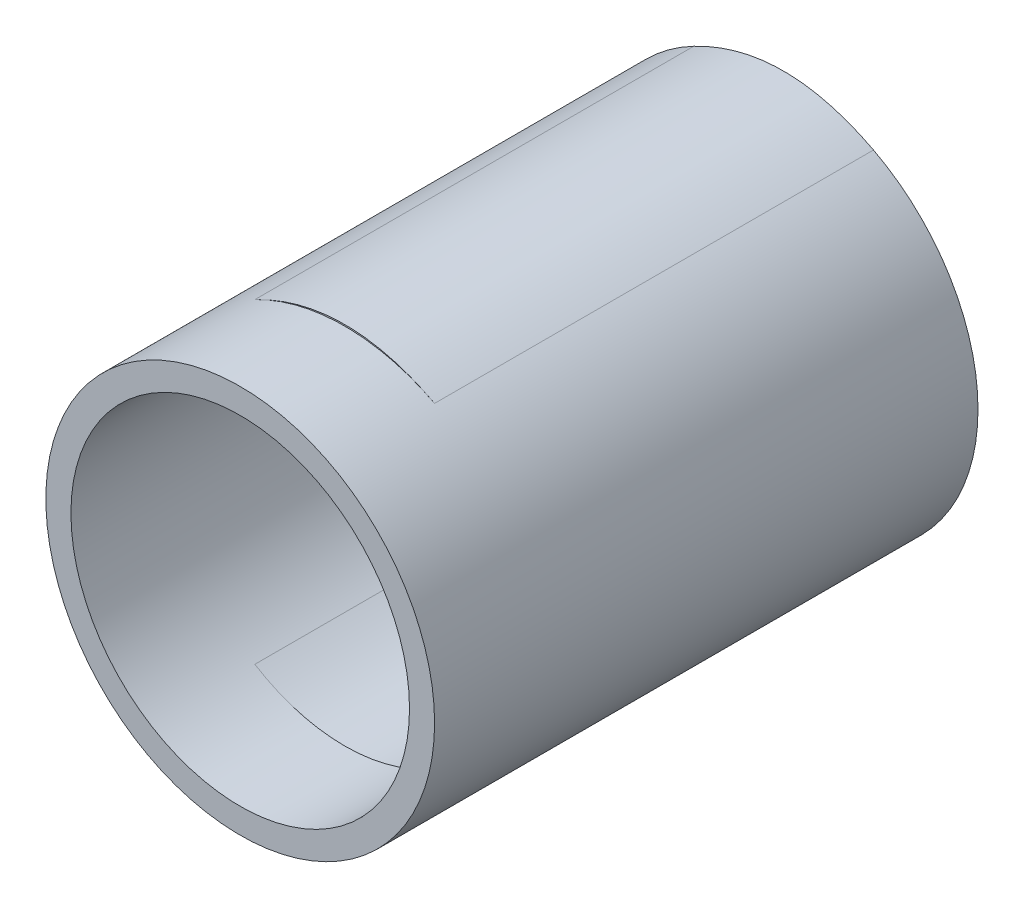
ISO-10303-21;
HEADER;
FILE_DESCRIPTION(('STEP AP214'),'2;1');
FILE_NAME('part.step','',(''),(''),'','','');
FILE_SCHEMA(('AUTOMOTIVE_DESIGN { 1 0 10303 214 1 1 1 1 }'));
ENDSEC;
DATA;
#1=APPLICATION_CONTEXT('core data for automotive mechanical design processes');
#2=APPLICATION_PROTOCOL_DEFINITION('international standard','automotive_design',2000,#1);
#3=PRODUCT_CONTEXT('',#1,'mechanical');
#4=PRODUCT('Part','Part','',(#3));
#5=PRODUCT_RELATED_PRODUCT_CATEGORY('part','',(#4));
#6=PRODUCT_DEFINITION_FORMATION('','',#4);
#7=PRODUCT_DEFINITION_CONTEXT('part definition',#1,'design');
#8=PRODUCT_DEFINITION('design','',#6,#7);
#9=PRODUCT_DEFINITION_SHAPE('','',#8);
#10=(LENGTH_UNIT() NAMED_UNIT(*) SI_UNIT(.MILLI.,.METRE.));
#11=(NAMED_UNIT(*) PLANE_ANGLE_UNIT() SI_UNIT($,.RADIAN.));
#12=(NAMED_UNIT(*) SI_UNIT($,.STERADIAN.) SOLID_ANGLE_UNIT());
#13=UNCERTAINTY_MEASURE_WITH_UNIT(LENGTH_MEASURE(1.E-05),#10,'distance_accuracy_value','');
#14=(GEOMETRIC_REPRESENTATION_CONTEXT(3) GLOBAL_UNCERTAINTY_ASSIGNED_CONTEXT((#13)) GLOBAL_UNIT_ASSIGNED_CONTEXT((#10,
#11,#12)) REPRESENTATION_CONTEXT('',''));
#15=CARTESIAN_POINT('',(0.,0.,0.));
#16=DIRECTION('',(0.,0.,1.));
#17=DIRECTION('',(1.,0.,0.));
#18=AXIS2_PLACEMENT_3D('',#15,#16,#17);
#19=CARTESIAN_POINT('',(0.,0.,2600.));
#20=DIRECTION('',(0.,0.,1.));
#21=DIRECTION('',(1.,0.,0.));
#22=AXIS2_PLACEMENT_3D('',#19,#20,#21);
#23=PLANE('',#22);
#24=CARTESIAN_POINT('',(-2800.,122.630047172472,2600.));
#25=DIRECTION('',(0.,0.,1.));
#26=DIRECTION('',(1.,0.,0.));
#27=AXIS2_PLACEMENT_3D('',#24,#25,#26);
#28=CIRCLE('',#27,930.);
#29=CARTESIAN_POINT('',(-1870.,122.630047172472,2600.));
#30=VERTEX_POINT('',#29);
#31=EDGE_CURVE('P0_E253',#30,#30,#28,.T.);
#32=ORIENTED_EDGE('',*,*,#31,.T.);
#33=EDGE_LOOP('',(#32));
#34=FACE_BOUND('',#33,.T.);
#35=CARTESIAN_POINT('',(-2800.,122.630047172471,2600.));
#36=DIRECTION('',(0.,0.,1.));
#37=DIRECTION('',(1.,0.,0.));
#38=AXIS2_PLACEMENT_3D('',#35,#36,#37);
#39=CIRCLE('',#38,810.);
#40=CARTESIAN_POINT('',(-1990.,122.630047172471,2600.));
#41=VERTEX_POINT('',#40);
#42=EDGE_CURVE('P0_E10',#41,#41,#39,.T.);
#43=ORIENTED_EDGE('',*,*,#42,.F.);
#44=EDGE_LOOP('',(#43));
#45=FACE_BOUND('',#44,.T.);
#46=ADVANCED_FACE('P0_F16',(#34,#45),#23,.T.);
#47=CARTESIAN_POINT('',(-2800.,122.630047172472,1300.));
#48=DIRECTION('',(0.,0.,1.));
#49=DIRECTION('',(1.,0.,0.));
#50=AXIS2_PLACEMENT_3D('',#47,#48,#49);
#51=CYLINDRICAL_SURFACE('',#50,930.);
#52=ORIENTED_EDGE('',*,*,#31,.F.);
#53=EDGE_LOOP('',(#52));
#54=FACE_BOUND('',#53,.T.);
#55=CARTESIAN_POINT('',(-2800.,122.630047172472,2100.));
#56=DIRECTION('',(0.,0.,-1.));
#57=DIRECTION('',(1.,0.,0.));
#58=AXIS2_PLACEMENT_3D('',#55,#56,#57);
#59=CIRCLE('',#58,930.);
#60=CARTESIAN_POINT('',(-3230.,947.251172296004,2100.));
#61=VERTEX_POINT('',#60);
#62=CARTESIAN_POINT('',(-2370.00131801305,947.251859574671,2100.));
#63=VERTEX_POINT('',#62);
#64=EDGE_CURVE('P0_E33',#61,#63,#59,.T.);
#65=ORIENTED_EDGE('',*,*,#64,.F.);
#66=DIRECTION('',(0.,0.,1.));
#67=VECTOR('',#66,1.);
#68=CARTESIAN_POINT('',(-3230.,947.251172296004,1300.));
#69=LINE('',#68,#67);
#70=CARTESIAN_POINT('',(-3230.,947.251172296004,0.));
#71=VERTEX_POINT('',#70);
#72=EDGE_CURVE('P0_E191',#71,#61,#69,.T.);
#73=ORIENTED_EDGE('',*,*,#72,.F.);
#74=CARTESIAN_POINT('',(-2800.,122.630047172472,0.));
#75=DIRECTION('',(0.,0.,1.));
#76=DIRECTION('',(1.,0.,0.));
#77=AXIS2_PLACEMENT_3D('',#74,#75,#76);
#78=CIRCLE('',#77,930.);
#79=CARTESIAN_POINT('',(-3230.,-701.99107795106,0.));
#80=VERTEX_POINT('',#79);
#81=EDGE_CURVE('P0_E120',#71,#80,#78,.T.);
#82=ORIENTED_EDGE('',*,*,#81,.T.);
#83=DIRECTION('',(0.,0.,1.));
#84=VECTOR('',#83,1.);
#85=CARTESIAN_POINT('',(-3230.,-701.99107795106,1300.));
#86=LINE('',#85,#84);
#87=CARTESIAN_POINT('',(-3230.,-701.99107795106,2100.));
#88=VERTEX_POINT('',#87);
#89=EDGE_CURVE('P0_E174',#80,#88,#86,.T.);
#90=ORIENTED_EDGE('',*,*,#89,.T.);
#91=CARTESIAN_POINT('',(-2800.,122.630047172472,2100.));
#92=DIRECTION('',(0.,0.,-1.));
#93=DIRECTION('',(1.,0.,0.));
#94=AXIS2_PLACEMENT_3D('',#91,#92,#93);
#95=CIRCLE('',#94,930.);
#96=CARTESIAN_POINT('',(-2370.00222482594,-701.99223808709,2100.));
#97=VERTEX_POINT('',#96);
#98=EDGE_CURVE('P0_E197',#97,#88,#95,.T.);
#99=ORIENTED_EDGE('',*,*,#98,.F.);
#100=CARTESIAN_POINT('',(-2800.,122.630047172472,2100.));
#101=DIRECTION('',(0.,0.,1.));
#102=DIRECTION('',(1.,0.,0.));
#103=AXIS2_PLACEMENT_3D('',#100,#101,#102);
#104=CIRCLE('',#103,930.);
#105=CARTESIAN_POINT('',(-2370.00000000001,-701.991077951063,2100.));
#106=VERTEX_POINT('',#105);
#107=EDGE_CURVE('P0_E119',#97,#106,#104,.T.);
#108=ORIENTED_EDGE('',*,*,#107,.T.);
#109=DIRECTION('',(0.,0.,1.));
#110=VECTOR('',#109,1.);
#111=CARTESIAN_POINT('',(-2370.,-701.99107795106,1300.));
#112=LINE('',#111,#110);
#113=CARTESIAN_POINT('',(-2370.00000000001,-701.991077951059,0.));
#114=VERTEX_POINT('',#113);
#115=EDGE_CURVE('P0_E113',#114,#106,#112,.T.);
#116=ORIENTED_EDGE('',*,*,#115,.F.);
#117=CARTESIAN_POINT('',(-2800.,122.630047172472,0.));
#118=DIRECTION('',(0.,0.,1.));
#119=DIRECTION('',(1.,0.,0.));
#120=AXIS2_PLACEMENT_3D('',#117,#118,#119);
#121=CIRCLE('',#120,930.);
#122=CARTESIAN_POINT('',(-2370.,947.251172296004,0.));
#123=VERTEX_POINT('',#122);
#124=EDGE_CURVE('P0_E108',#114,#123,#121,.T.);
#125=ORIENTED_EDGE('',*,*,#124,.T.);
#126=DIRECTION('',(0.,0.,1.));
#127=VECTOR('',#126,1.);
#128=CARTESIAN_POINT('',(-2370.,947.251172296004,1300.));
#129=LINE('',#128,#127);
#130=CARTESIAN_POINT('',(-2370.,947.251172296004,2100.));
#131=VERTEX_POINT('',#130);
#132=EDGE_CURVE('P0_E111',#123,#131,#129,.T.);
#133=ORIENTED_EDGE('',*,*,#132,.T.);
#134=CARTESIAN_POINT('',(-2800.,122.630047172472,2100.));
#135=DIRECTION('',(0.,0.,-1.));
#136=DIRECTION('',(1.,0.,0.));
#137=AXIS2_PLACEMENT_3D('',#134,#135,#136);
#138=CIRCLE('',#137,930.);
#139=EDGE_CURVE('P0_E42',#63,#131,#138,.T.);
#140=ORIENTED_EDGE('',*,*,#139,.F.);
#141=EDGE_LOOP('',(#65,#73,#82,#90,#99,#108,#116,#125,#133,#140));
#142=FACE_BOUND('',#141,.T.);
#143=ADVANCED_FACE('P0_F110',(#54,#142),#51,.T.);
#144=CARTESIAN_POINT('',(-2800.,122.630047172471,1250.));
#145=DIRECTION('',(0.,0.,1.));
#146=DIRECTION('',(1.,0.,0.));
#147=AXIS2_PLACEMENT_3D('',#144,#145,#146);
#148=CYLINDRICAL_SURFACE('',#147,810.);
#149=CARTESIAN_POINT('',(-2800.,122.630047172471,0.));
#150=DIRECTION('',(0.,0.,1.));
#151=DIRECTION('',(1.,0.,0.));
#152=AXIS2_PLACEMENT_3D('',#149,#150,#151);
#153=CIRCLE('',#152,810.);
#154=CARTESIAN_POINT('',(-3230.,809.070139241692,0.));
#155=VERTEX_POINT('',#154);
#156=CARTESIAN_POINT('',(-3230.,-563.810044896749,0.));
#157=VERTEX_POINT('',#156);
#158=EDGE_CURVE('P0_E261',#155,#157,#153,.T.);
#159=ORIENTED_EDGE('',*,*,#158,.F.);
#160=DIRECTION('',(0.,0.,1.));
#161=VECTOR('',#160,1.);
#162=CARTESIAN_POINT('',(-3230.,809.070139241692,1250.));
#163=LINE('',#162,#161);
#164=CARTESIAN_POINT('',(-3230.,809.070139241691,2100.));
#165=VERTEX_POINT('',#164);
#166=EDGE_CURVE('P0_E129',#155,#165,#163,.T.);
#167=ORIENTED_EDGE('',*,*,#166,.T.);
#168=CARTESIAN_POINT('',(-2800.,122.630047172471,2100.));
#169=DIRECTION('',(0.,0.,-1.));
#170=DIRECTION('',(1.,0.,0.));
#171=AXIS2_PLACEMENT_3D('',#168,#169,#170);
#172=CIRCLE('',#171,810.);
#173=CARTESIAN_POINT('',(-2370.00122280143,809.070905227799,2100.));
#174=VERTEX_POINT('',#173);
#175=EDGE_CURVE('P0_E275',#165,#174,#172,.T.);
#176=ORIENTED_EDGE('',*,*,#175,.T.);
#177=CARTESIAN_POINT('',(-2800.,122.630047172471,2100.));
#178=DIRECTION('',(0.,0.,-1.));
#179=DIRECTION('',(1.,0.,0.));
#180=AXIS2_PLACEMENT_3D('',#177,#178,#179);
#181=CIRCLE('',#180,810.);
#182=CARTESIAN_POINT('',(-2370.,809.070139241692,2100.));
#183=VERTEX_POINT('',#182);
#184=EDGE_CURVE('P0_E155',#174,#183,#181,.T.);
#185=ORIENTED_EDGE('',*,*,#184,.T.);
#186=DIRECTION('',(0.,0.,1.));
#187=VECTOR('',#186,1.);
#188=CARTESIAN_POINT('',(-2370.,809.070139241692,1250.));
#189=LINE('',#188,#187);
#190=CARTESIAN_POINT('',(-2370.,809.070139241692,0.));
#191=VERTEX_POINT('',#190);
#192=EDGE_CURVE('P0_E207',#191,#183,#189,.T.);
#193=ORIENTED_EDGE('',*,*,#192,.F.);
#194=CARTESIAN_POINT('',(-2800.,122.630047172471,0.));
#195=DIRECTION('',(0.,0.,1.));
#196=DIRECTION('',(1.,0.,0.));
#197=AXIS2_PLACEMENT_3D('',#194,#195,#196);
#198=CIRCLE('',#197,810.);
#199=CARTESIAN_POINT('',(-2370.00000000001,-563.810044896748,0.));
#200=VERTEX_POINT('',#199);
#201=EDGE_CURVE('P0_E266',#200,#191,#198,.T.);
#202=ORIENTED_EDGE('',*,*,#201,.F.);
#203=DIRECTION('',(0.,0.,1.));
#204=VECTOR('',#203,1.);
#205=CARTESIAN_POINT('',(-2370.,-563.810044896749,1250.));
#206=LINE('',#205,#204);
#207=CARTESIAN_POINT('',(-2370.,-563.81004489675,2100.));
#208=VERTEX_POINT('',#207);
#209=EDGE_CURVE('P0_E144',#200,#208,#206,.T.);
#210=ORIENTED_EDGE('',*,*,#209,.T.);
#211=CARTESIAN_POINT('',(-2800.,122.630047172471,2100.));
#212=DIRECTION('',(0.,0.,1.));
#213=DIRECTION('',(1.,0.,0.));
#214=AXIS2_PLACEMENT_3D('',#211,#212,#213);
#215=CIRCLE('',#214,810.);
#216=CARTESIAN_POINT('',(-2370.00181964397,-563.811184755291,2100.));
#217=VERTEX_POINT('',#216);
#218=EDGE_CURVE('P0_E69',#217,#208,#215,.T.);
#219=ORIENTED_EDGE('',*,*,#218,.F.);
#220=CARTESIAN_POINT('',(-2800.,122.630047172471,2100.));
#221=DIRECTION('',(0.,0.,-1.));
#222=DIRECTION('',(1.,0.,0.));
#223=AXIS2_PLACEMENT_3D('',#220,#221,#222);
#224=CIRCLE('',#223,810.);
#225=CARTESIAN_POINT('',(-3230.,-563.810044896749,2100.));
#226=VERTEX_POINT('',#225);
#227=EDGE_CURVE('P0_E56',#217,#226,#224,.T.);
#228=ORIENTED_EDGE('',*,*,#227,.T.);
#229=DIRECTION('',(0.,0.,1.));
#230=VECTOR('',#229,1.);
#231=CARTESIAN_POINT('',(-3230.,-563.810044896749,1250.));
#232=LINE('',#231,#230);
#233=EDGE_CURVE('P0_E204',#157,#226,#232,.T.);
#234=ORIENTED_EDGE('',*,*,#233,.F.);
#235=EDGE_LOOP('',(#159,#167,#176,#185,#193,#202,#210,#219,#228,#234));
#236=FACE_BOUND('',#235,.T.);
#237=ORIENTED_EDGE('',*,*,#42,.T.);
#238=EDGE_LOOP('',(#237));
#239=FACE_BOUND('',#238,.T.);
#240=ADVANCED_FACE('P0_F224',(#236,#239),#148,.F.);
#241=CARTESIAN_POINT('',(-2800.,878.160655768848,2100.));
#242=DIRECTION('',(0.,0.,1.));
#243=DIRECTION('',(1.,0.,0.));
#244=AXIS2_PLACEMENT_3D('',#241,#242,#243);
#245=PLANE('',#244);
#246=ORIENTED_EDGE('',*,*,#64,.T.);
#247=CARTESIAN_POINT('',(-3230.,947.251172296004,2100.));
#248=CARTESIAN_POINT('',(-3222.20092994091,951.318019474959,2100.));
#249=CARTESIAN_POINT('',(-3214.35633617281,955.297943324625,2100.));
#250=CARTESIAN_POINT('',(-3198.56849206611,963.079979662334,2100.));
#251=CARTESIAN_POINT('',(-3190.6251406006,966.881886921991,2100.));
#252=CARTESIAN_POINT('',(-3174.64368885549,974.297537491168,2100.));
#253=CARTESIAN_POINT('',(-3166.60552137445,977.911136115052,2100.));
#254=CARTESIAN_POINT('',(-3150.43860917072,984.940089923465,2100.));
#255=CARTESIAN_POINT('',(-3142.30982527482,988.355355067149,2100.));
#256=CARTESIAN_POINT('',(-3125.96597668347,994.977926893992,2100.));
#257=CARTESIAN_POINT('',(-3117.75089464635,998.185190812937,2100.));
#258=CARTESIAN_POINT('',(-3101.2389246426,1004.38242664369,2100.));
#259=CARTESIAN_POINT('',(-3092.94203505006,1007.37239422687,2100.));
#260=CARTESIAN_POINT('',(-3076.2903998265,1013.11946625621,2100.));
#261=CARTESIAN_POINT('',(-3067.93584278906,1015.87711670302,2100.));
#262=CARTESIAN_POINT('',(-3051.15508013722,1021.15876065921,2100.));
#263=CARTESIAN_POINT('',(-3042.72889009613,1023.68280360561,2100.));
#264=CARTESIAN_POINT('',(-3025.80992339723,1028.48934931005,2100.));
#265=CARTESIAN_POINT('',(-3017.31716242277,1030.771907225,2100.));
#266=CARTESIAN_POINT('',(-3000.27025900866,1035.08815830342,2100.));
#267=CARTESIAN_POINT('',(-2991.71612828112,1037.12189768198,2100.));
#268=CARTESIAN_POINT('',(-2974.55183985286,1040.933777964,2100.));
#269=CARTESIAN_POINT('',(-2965.94168713535,1042.71194128492,2100.));
#270=CARTESIAN_POINT('',(-2948.67087149232,1046.00655901062,2100.));
#271=CARTESIAN_POINT('',(-2940.01020554205,1047.52299757329,2100.));
#272=CARTESIAN_POINT('',(-2922.56383315789,1050.30148487971,2100.));
#273=CARTESIAN_POINT('',(-2913.77772003236,1051.5609831664,2100.));
#274=CARTESIAN_POINT('',(-2896.16842966723,1053.80263733334,2100.));
#275=CARTESIAN_POINT('',(-2887.3452456055,1054.78473967225,2100.));
#276=CARTESIAN_POINT('',(-2869.67114395763,1056.46741383455,2100.));
#277=CARTESIAN_POINT('',(-2860.82022365672,1057.16795717326,2100.));
#278=CARTESIAN_POINT('',(-2843.10006341592,1058.28452391017,2100.));
#279=CARTESIAN_POINT('',(-2834.23082272278,1058.7005353664,2100.));
#280=CARTESIAN_POINT('',(-2816.48351277988,1059.24626594586,2100.));
#281=CARTESIAN_POINT('',(-2807.60544351442,1059.37598455927,2100.));
#282=CARTESIAN_POINT('',(-2789.85004608982,1059.34858710436,2100.));
#283=CARTESIAN_POINT('',(-2780.97271791579,1059.19148066462,2100.));
#284=CARTESIAN_POINT('',(-2763.22813434758,1058.59112018387,2100.));
#285=CARTESIAN_POINT('',(-2754.36087853746,1058.1478784234,2100.));
#286=CARTESIAN_POINT('',(-2736.64512432481,1056.9770922389,2100.));
#287=CARTESIAN_POINT('',(-2727.79662602917,1056.24954619912,2100.));
#288=CARTESIAN_POINT('',(-2710.1273352437,1054.51313147191,2100.));
#289=CARTESIAN_POINT('',(-2701.30654266078,1053.50426373069,2100.));
#290=CARTESIAN_POINT('',(-2683.70145984631,1051.20929628689,2100.));
#291=CARTESIAN_POINT('',(-2674.91716828037,1049.92320681148,2100.));
#292=CARTESIAN_POINT('',(-2657.3937654439,1047.07896923277,2100.));
#293=CARTESIAN_POINT('',(-2648.65464943229,1045.5208503008,2100.));
#294=CARTESIAN_POINT('',(-2631.23005684041,1042.13874207667,2100.));
#295=CARTESIAN_POINT('',(-2622.54456861036,1040.31481280933,2100.));
#296=CARTESIAN_POINT('',(-2606.81081299419,1036.76381600275,2100.));
#297=CARTESIAN_POINT('',(-2599.75280093338,1035.07973297853,2100.));
#298=CARTESIAN_POINT('',(-2585.68040813758,1031.54237243682,2099.99999999999));
#299=CARTESIAN_POINT('',(-2578.66602105573,1029.68912017688,2100.));
#300=CARTESIAN_POINT('',(-2564.68328999383,1025.8175085949,2100.));
#301=CARTESIAN_POINT('',(-2557.71494425634,1023.79915561476,2100.));
#302=CARTESIAN_POINT('',(-2543.82658561274,1019.60161240587,2100.));
#303=CARTESIAN_POINT('',(-2536.90657465186,1017.42241574431,2099.99999999999));
#304=CARTESIAN_POINT('',(-2523.11713618799,1012.90763895494,2099.99999999999));
#305=CARTESIAN_POINT('',(-2516.24771302651,1010.57204557464,2099.99999999999));
#306=CARTESIAN_POINT('',(-2502.56164372699,1005.74910003591,2099.99999999999));
#307=CARTESIAN_POINT('',(-2495.74500267062,1003.26173346509,2099.99999999999));
#308=CARTESIAN_POINT('',(-2482.17066506508,998.141545784248,2099.99999999999));
#309=CARTESIAN_POINT('',(-2475.41293959354,995.508801310022,2099.99999999999));
#310=CARTESIAN_POINT('',(-2461.95446553923,990.101456153092,2099.99999999999));
#311=CARTESIAN_POINT('',(-2455.25371730089,987.326854613552,2099.99999999999));
#312=CARTESIAN_POINT('',(-2441.91119866743,981.640851453466,2099.99999999999));
#313=CARTESIAN_POINT('',(-2435.26942345761,978.729461125091,2099.99999999999));
#314=CARTESIAN_POINT('',(-2422.04679195197,972.775059359622,2099.99999999999));
#315=CARTESIAN_POINT('',(-2415.46592351065,969.732074881754,2099.99999999999));
#316=CARTESIAN_POINT('',(-2402.36700957232,963.519785817767,2099.99999999999));
#317=CARTESIAN_POINT('',(-2395.84894240782,960.350526889155,2099.99999999999));
#318=CARTESIAN_POINT('',(-2382.87743301018,953.891074705706,2099.99999999999));
#319=CARTESIAN_POINT('',(-2376.42395746419,950.600948362612,2099.99999999999));
#320=CARTESIAN_POINT('',(-2370.00131801294,947.251859574894,2100.));
#321=B_SPLINE_CURVE_WITH_KNOTS('',3,(#247,#248,#249,#250,#251,#252,#253,#254,#255,#256,#257,
#258,#259,#260,#261,#262,#263,#264,#265,#266,#267,#268,#269,#270,#271,#272,#273,#274,#275,#276,
#277,#278,#279,#280,#281,#282,#283,#284,#285,#286,#287,#288,#289,#290,#291,#292,#293,#294,#295,
#296,#297,#298,#299,#300,#301,#302,#303,#304,#305,#306,#307,#308,#309,#310,#311,#312,#313,#314,
#315,#316,#317,#318,#319,#320),.UNSPECIFIED.,.F.,.F.,(4,2,2,2,2,2,2,2,2,2,2,2,2,2,2,2,2,2,2,2,2,
2,2,2,2,2,2,2,2,2,2,2,2,2,2,2,4),(0.,26.3868803566043,52.8034676419651,79.2400613898281,
105.68856466482,132.142488518929,158.5969392029,184.987372260557,211.372207627873,
237.75100343899,264.124892239022,290.49646627905,316.869636020408,343.493061721773,
370.121622614404,396.752876780247,423.385248606111,450.017667858044,476.649193088612,
503.279575404532,529.910109068869,556.540553165901,583.170014991701,609.796622935783,
636.417227397026,658.183619622164,679.946767347261,701.709079491946,723.472262475,
745.237291932137,767.004391426028,788.760123972941,810.515987942825,832.270059070266,
854.019694437728,875.761535834828,897.491517233458),.UNSPECIFIED.);
#322=EDGE_CURVE('P0_E135',#61,#63,#321,.T.);
#323=ORIENTED_EDGE('',*,*,#322,.F.);
#324=EDGE_LOOP('',(#246,#323));
#325=FACE_BOUND('',#324,.T.);
#326=ADVANCED_FACE('P0_F219',(#325),#245,.T.);
#327=CARTESIAN_POINT('',(-3230.,947.251172296004,2100.));
#328=CARTESIAN_POINT('',(-3230.,947.251172296004,0.));
#329=CARTESIAN_POINT('',(-3057.99999352763,1036.94084981018,2100.));
#330=CARTESIAN_POINT('',(-3057.99999352763,1036.94084980449,0.));
#331=CARTESIAN_POINT('',(-2886.00007800474,1081.78567533374,2100.));
#332=CARTESIAN_POINT('',(-2886.00007800474,1081.78570488096,0.));
#333=CARTESIAN_POINT('',(-2714.0000492785,1081.78569580198,2100.));
#334=CARTESIAN_POINT('',(-2714.0000492785,1081.78569580198,0.));
#335=CARTESIAN_POINT('',(-2542.00000644936,1036.94084981477,2100.));
#336=CARTESIAN_POINT('',(-2542.00000644936,1036.94084981477,0.));
#337=CARTESIAN_POINT('',(-2370.00000000001,947.251172296002,2100.));
#338=CARTESIAN_POINT('',(-2370.,947.251172296003,0.));
#339=B_SPLINE_SURFACE_WITH_KNOTS('',5,1,((#327,#328),(#329,#330),(#331,#332),(#333,#334),(#335,
#336),(#337,#338)),.UNSPECIFIED.,.F.,.F.,.F.,(6,6),(2,2),(0.,990.584508227356),(-1300.,800.),.UNSPECIFIED.);
#340=CARTESIAN_POINT('',(-3230.,947.251172296004,0.));
#341=CARTESIAN_POINT('',(-3057.99999352763,1036.94084980449,0.));
#342=CARTESIAN_POINT('',(-2886.00007800474,1081.78570488096,0.));
#343=CARTESIAN_POINT('',(-2714.0000492785,1081.78569580198,0.));
#344=CARTESIAN_POINT('',(-2542.00000644936,1036.94084981477,0.));
#345=CARTESIAN_POINT('',(-2370.,947.251172296003,0.));
#346=B_SPLINE_CURVE_WITH_KNOTS('',5,(#340,#341,#342,#343,#344,#345),.UNSPECIFIED.,.F.,.F.,(6,6),
(0.,990.584508227356),.UNSPECIFIED.);
#347=EDGE_CURVE('P0_E126',#71,#123,#346,.T.);
#348=ORIENTED_EDGE('',*,*,#139,.T.);
#349=ORIENTED_EDGE('',*,*,#132,.F.);
#350=ORIENTED_EDGE('',*,*,#347,.F.);
#351=ORIENTED_EDGE('',*,*,#72,.T.);
#352=ORIENTED_EDGE('',*,*,#322,.T.);
#353=EDGE_LOOP('',(#348,#349,#350,#351,#352));
#354=FACE_BOUND('',#353,.T.);
#355=ADVANCED_FACE('P0_F124',(#354),#339,.T.);
#356=CARTESIAN_POINT('',(-3230.,809.070139241692,0.));
#357=CARTESIAN_POINT('',(-3230.,809.070139241692,2100.));
#358=CARTESIAN_POINT('',(-3057.99999355947,916.814432789705,0.));
#359=CARTESIAN_POINT('',(-3057.99999352763,916.81443278402,2100.));
#360=CARTESIAN_POINT('',(-2885.99995073914,970.686556676252,0.));
#361=CARTESIAN_POINT('',(-2886.00007800474,970.686554391147,2100.));
#362=CARTESIAN_POINT('',(-2714.0000492785,970.686586240357,0.));
#363=CARTESIAN_POINT('',(-2714.0000492785,970.686588525463,2100.));
#364=CARTESIAN_POINT('',(-2542.00000644936,916.814432795229,0.));
#365=CARTESIAN_POINT('',(-2542.00000644936,916.814432800914,2100.));
#366=CARTESIAN_POINT('',(-2370.00000000001,809.07013924169,0.));
#367=CARTESIAN_POINT('',(-2370.00000000001,809.07013924169,2100.));
#368=B_SPLINE_SURFACE_WITH_KNOTS('',5,1,((#356,#357),(#358,#359),(#360,#361),(#362,#363),(#364,
#365),(#366,#367)),.UNSPECIFIED.,.F.,.F.,.F.,(6,6),(2,2),(0.,990.584508227356),(-1250.,850.),.UNSPECIFIED.);
#369=CARTESIAN_POINT('',(-3230.,809.070139241692,0.));
#370=CARTESIAN_POINT('',(-3057.99999355947,916.814432789705,0.));
#371=CARTESIAN_POINT('',(-2885.99995073914,970.686556676252,0.));
#372=CARTESIAN_POINT('',(-2714.0000492785,970.686586240357,0.));
#373=CARTESIAN_POINT('',(-2542.00000644936,916.814432795229,0.));
#374=CARTESIAN_POINT('',(-2370.00000000001,809.07013924169,0.));
#375=B_SPLINE_CURVE_WITH_KNOTS('',5,(#369,#370,#371,#372,#373,#374),.UNSPECIFIED.,.F.,.F.,(6,6),
(0.,990.584508227356),.UNSPECIFIED.);
#376=EDGE_CURVE('P0_E183',#155,#191,#375,.T.);
#377=CARTESIAN_POINT('',(-3230.,809.070139241692,2100.));
#378=CARTESIAN_POINT('',(-3058.00023808778,916.814279586582,2100.));
#379=CARTESIAN_POINT('',(-2886.00056712478,970.68640119367,2100.));
#380=CARTESIAN_POINT('',(-2714.00078295904,970.68658852499,2100.));
#381=CARTESIAN_POINT('',(-2542.00098469016,916.814739195189,2100.));
#382=CARTESIAN_POINT('',(-2370.00122280075,809.070905227795,2100.));
#383=B_SPLINE_CURVE_WITH_KNOTS('',5,(#377,#378,#379,#380,#381,#382),.UNSPECIFIED.,.F.,.F.,(6,6),
(0.,990.583099753602),.UNSPECIFIED.);
#384=EDGE_CURVE('P0_E146',#165,#174,#383,.T.);
#385=ORIENTED_EDGE('',*,*,#376,.T.);
#386=ORIENTED_EDGE('',*,*,#192,.T.);
#387=ORIENTED_EDGE('',*,*,#184,.F.);
#388=ORIENTED_EDGE('',*,*,#384,.F.);
#389=ORIENTED_EDGE('',*,*,#166,.F.);
#390=EDGE_LOOP('',(#385,#386,#387,#388,#389));
#391=FACE_BOUND('',#390,.T.);
#392=ADVANCED_FACE('P0_F230',(#391),#368,.T.);
#393=CARTESIAN_POINT('',(-3230.,122.630047172472,2100.));
#394=DIRECTION('',(0.,0.,-1.));
#395=DIRECTION('',(-1.,0.,0.));
#396=AXIS2_PLACEMENT_3D('',#393,#394,#395);
#397=PLANE('',#396);
#398=ORIENTED_EDGE('',*,*,#384,.T.);
#399=ORIENTED_EDGE('',*,*,#175,.F.);
#400=EDGE_LOOP('',(#398,#399));
#401=FACE_BOUND('',#400,.T.);
#402=ADVANCED_FACE('P0_F227',(#401),#397,.T.);
#403=CARTESIAN_POINT('',(-3230.,122.630047172472,2100.));
#404=DIRECTION('',(0.,0.,-1.));
#405=DIRECTION('',(-1.,0.,0.));
#406=AXIS2_PLACEMENT_3D('',#403,#404,#405);
#407=PLANE('',#406);
#408=CARTESIAN_POINT('',(-3230.,-563.810044896749,2100.));
#409=CARTESIAN_POINT('',(-3223.22155236649,-568.056179247852,2100.));
#410=CARTESIAN_POINT('',(-3216.39781037365,-572.230327801503,2100.));
#411=CARTESIAN_POINT('',(-3202.64884224145,-580.432945951803,2100.));
#412=CARTESIAN_POINT('',(-3195.72347377319,-584.461176903298,2100.));
#413=CARTESIAN_POINT('',(-3181.77403086753,-592.361179652047,2100.));
#414=CARTESIAN_POINT('',(-3174.74985730047,-596.232776580872,2100.));
#415=CARTESIAN_POINT('',(-3160.6057743509,-603.808819869926,2100.));
#416=CARTESIAN_POINT('',(-3153.48580352949,-607.513151604322,2100.));
#417=CARTESIAN_POINT('',(-3139.15318402017,-614.744200963067,2100.));
#418=CARTESIAN_POINT('',(-3131.9405052369,-618.270858983767,2100.));
#419=CARTESIAN_POINT('',(-3117.42566306149,-625.136318731161,2100.));
#420=CARTESIAN_POINT('',(-3110.12349407277,-628.475108635119,2100.));
#421=CARTESIAN_POINT('',(-3095.38625449391,-634.975468627288,2100.));
#422=CARTESIAN_POINT('',(-3087.95063942295,-638.135805453911,2100.));
#423=CARTESIAN_POINT('',(-3072.99592001022,-644.246145554585,2100.));
#424=CARTESIAN_POINT('',(-3065.47684047647,-647.196209490244,2100.));
#425=CARTESIAN_POINT('',(-3050.35894777146,-652.876464541847,2100.));
#426=CARTESIAN_POINT('',(-3042.76016281115,-655.606730669864,2100.));
#427=CARTESIAN_POINT('',(-3027.48674650829,-660.838241663496,2100.));
#428=CARTESIAN_POINT('',(-3019.81213974615,-663.339558216126,2100.));
#429=CARTESIAN_POINT('',(-3004.3911399556,-668.104441573945,2100.));
#430=CARTESIAN_POINT('',(-2996.64476198433,-670.368057070953,2100.));
#431=CARTESIAN_POINT('',(-2981.08433816092,-674.649286731058,2100.));
#432=CARTESIAN_POINT('',(-2973.27029355099,-676.666905399889,2100.));
#433=CARTESIAN_POINT('',(-2959.01219597416,-680.102981040412,2100.));
#434=CARTESIAN_POINT('',(-2952.57827411557,-681.563595145187,2100.));
#435=CARTESIAN_POINT('',(-2939.6725384801,-684.310897706825,2100.));
#436=CARTESIAN_POINT('',(-2933.20072029534,-685.597565494466,2100.));
#437=CARTESIAN_POINT('',(-2920.22396045497,-687.992992583917,2100.));
#438=CARTESIAN_POINT('',(-2913.71901748972,-689.101744794233,2100.));
#439=CARTESIAN_POINT('',(-2900.68080100647,-691.137894332487,2100.));
#440=CARTESIAN_POINT('',(-2894.14752755853,-692.065292108496,2100.));
#441=CARTESIAN_POINT('',(-2881.05754344444,-693.735815980085,2100.));
#442=CARTESIAN_POINT('',(-2874.50083312233,-694.478944769321,2100.));
#443=CARTESIAN_POINT('',(-2861.36894945912,-695.778566120534,2100.));
#444=CARTESIAN_POINT('',(-2854.79377618487,-696.335059357296,2100.));
#445=CARTESIAN_POINT('',(-2841.65782124085,-697.25765972779,2100.));
#446=CARTESIAN_POINT('',(-2835.09709505616,-697.624556410774,2100.));
#447=CARTESIAN_POINT('',(-2821.96760177988,-698.170293806298,2100.));
#448=CARTESIAN_POINT('',(-2815.39883443052,-698.349128323194,2100.));
#449=CARTESIAN_POINT('',(-2802.25880714002,-698.518132002367,2100.));
#450=CARTESIAN_POINT('',(-2795.68754717478,-698.508299292465,2100.));
#451=CARTESIAN_POINT('',(-2782.5480661663,-698.299996496673,2100.));
#452=CARTESIAN_POINT('',(-2775.9798451005,-698.101527833999,2100.));
#453=CARTESIAN_POINT('',(-2762.85198518757,-697.516619418593,2100.));
#454=CARTESIAN_POINT('',(-2756.29234610185,-697.130185007688,2100.));
#455=CARTESIAN_POINT('',(-2743.18710363938,-696.170628900065,2100.));
#456=CARTESIAN_POINT('',(-2736.64149942334,-695.597518698869,2100.));
#457=CARTESIAN_POINT('',(-2725.21061678679,-694.433610514281,2100.));
#458=CARTESIAN_POINT('',(-2720.3211616891,-693.883393518058,2100.));
#459=CARTESIAN_POINT('',(-2710.55479752477,-692.680281225017,2100.));
#460=CARTESIAN_POINT('',(-2705.67788865988,-692.027384287524,2100.));
#461=CARTESIAN_POINT('',(-2695.93878350654,-690.620068458106,2100.));
#462=CARTESIAN_POINT('',(-2691.07658713502,-689.865650140611,2100.));
#463=CARTESIAN_POINT('',(-2681.3687004594,-688.256569563997,2100.));
#464=CARTESIAN_POINT('',(-2676.52301053696,-687.401905002964,2100.));
#465=CARTESIAN_POINT('',(-2666.84997113224,-685.593763133907,2100.));
#466=CARTESIAN_POINT('',(-2662.02262216179,-684.640283088989,2100.));
#467=CARTESIAN_POINT('',(-2652.38804848707,-682.636080143906,2100.));
#468=CARTESIAN_POINT('',(-2647.5808242384,-681.585355054576,2100.));
#469=CARTESIAN_POINT('',(-2637.98849623246,-679.388422886517,2100.));
#470=CARTESIAN_POINT('',(-2633.20339141579,-678.242220431795,2100.));
#471=CARTESIAN_POINT('',(-2623.65652001578,-675.856059721826,2100.));
#472=CARTESIAN_POINT('',(-2618.89475393937,-674.616099439671,2100.));
#473=CARTESIAN_POINT('',(-2609.38034083996,-672.040058159441,2100.));
#474=CARTESIAN_POINT('',(-2604.62777636971,-670.703672158264,2100.));
#475=CARTESIAN_POINT('',(-2595.14899478492,-667.940414061766,2100.));
#476=CARTESIAN_POINT('',(-2590.42277822266,-666.513540077434,2100.));
#477=CARTESIAN_POINT('',(-2576.28618154978,-662.10042524533,2100.));
#478=CARTESIAN_POINT('',(-2566.91689090044,-658.981429961034,2100.));
#479=CARTESIAN_POINT('',(-2548.29803539629,-652.406843046709,2100.));
#480=CARTESIAN_POINT('',(-2539.04846667124,-648.951262328356,2100.));
#481=CARTESIAN_POINT('',(-2520.67649719748,-641.721239867844,2100.));
#482=CARTESIAN_POINT('',(-2511.55407509729,-637.946852432547,2100.));
#483=CARTESIAN_POINT('',(-2497.89084170527,-632.025229762634,2100.));
#484=CARTESIAN_POINT('',(-2493.30123427661,-629.989723729652,2100.));
#485=CARTESIAN_POINT('',(-2484.15698729248,-625.84319708869,2100.));
#486=CARTESIAN_POINT('',(-2479.60234287566,-623.732187218781,2100.));
#487=CARTESIAN_POINT('',(-2470.52820846021,-619.436835024217,2100.));
#488=CARTESIAN_POINT('',(-2466.00871587664,-617.252498155779,2100.));
#489=CARTESIAN_POINT('',(-2457.0049830599,-612.812631889286,2100.));
#490=CARTESIAN_POINT('',(-2452.5207419466,-610.557104275716,2100.));
#491=CARTESIAN_POINT('',(-2443.58763748666,-605.976998623331,2100.));
#492=CARTESIAN_POINT('',(-2439.13877437156,-603.652420133058,2100.));
#493=CARTESIAN_POINT('',(-2430.30583687586,-598.951931756521,2100.));
#494=CARTESIAN_POINT('',(-2425.92152875258,-596.576460971012,2100.));
#495=CARTESIAN_POINT('',(-2417.18807176121,-591.761570011129,2100.));
#496=CARTESIAN_POINT('',(-2412.83892355461,-589.322148637258,2100.));
#497=CARTESIAN_POINT('',(-2404.17591655762,-584.381436611993,2100.));
#498=CARTESIAN_POINT('',(-2399.86205779631,-581.880145909646,2100.));
#499=CARTESIAN_POINT('',(-2391.2697663319,-576.817773251697,2100.));
#500=CARTESIAN_POINT('',(-2386.99133249645,-574.256693217326,2100.));
#501=CARTESIAN_POINT('',(-2378.47001785203,-569.076800502783,2100.));
#502=CARTESIAN_POINT('',(-2374.22713424743,-566.45799242223,2100.));
#503=CARTESIAN_POINT('',(-2370.00181964355,-563.811184755969,2100.));
#504=B_SPLINE_CURVE_WITH_KNOTS('',3,(#408,#409,#410,#411,#412,#413,#414,#415,#416,#417,#418,
#419,#420,#421,#422,#423,#424,#425,#426,#427,#428,#429,#430,#431,#432,#433,#434,#435,#436,#437,
#438,#439,#440,#441,#442,#443,#444,#445,#446,#447,#448,#449,#450,#451,#452,#453,#454,#455,#456,
#457,#458,#459,#460,#461,#462,#463,#464,#465,#466,#467,#468,#469,#470,#471,#472,#473,#474,#475,
#476,#477,#478,#479,#480,#481,#482,#483,#484,#485,#486,#487,#488,#489,#490,#491,#492,#493,#494,
#495,#496,#497,#498,#499,#500,#501,#502,#503),.UNSPECIFIED.,.F.,.F.,(4,2,2,2,2,2,2,2,2,2,2,2,2,
2,2,2,2,2,2,2,2,2,2,2,2,2,2,2,2,2,2,2,2,2,2,2,2,2,2,2,2,2,2,2,2,2,2,4),(0.,23.9954893867717,
48.0285973363725,72.0878347575275,96.1633170771009,120.246822866726,144.33184256515,
168.566867249653,192.794871836473,217.0145725827,241.226663704511,265.43378539095,
289.640463627565,309.431088607722,329.224063151605,349.017826423121,368.811540789863,
388.604965793743,408.398319233352,428.108567856085,447.819465805702,467.530559350075,
487.241504179765,506.951888873923,526.6610600294,541.420981331249,556.18113849882,
570.94121215364,585.701624804729,600.462446384621,615.223600338545,629.984039819143,
644.744798490485,659.554487251738,674.364485279261,703.981487990167,733.597530874518,
763.208538974145,778.270183665382,793.329694757854,808.388087754573,823.446103593203,
838.504217903393,853.46312223563,868.422307347107,883.381504778594,898.340222180949,
913.297751989821),.UNSPECIFIED.);
#505=EDGE_CURVE('P0_E22',#226,#217,#504,.T.);
#506=ORIENTED_EDGE('',*,*,#505,.F.);
#507=ORIENTED_EDGE('',*,*,#227,.F.);
#508=EDGE_LOOP('',(#506,#507));
#509=FACE_BOUND('',#508,.T.);
#510=ADVANCED_FACE('P0_F229',(#509),#407,.T.);
#511=CARTESIAN_POINT('',(-3230.,-563.810044896749,2100.));
#512=CARTESIAN_POINT('',(-3230.,-563.810044896749,0.));
#513=CARTESIAN_POINT('',(-3057.99997791866,-671.554348222542,2100.));
#514=CARTESIAN_POINT('',(-3057.99997795049,-671.554348222542,0.));
#515=CARTESIAN_POINT('',(-2886.00004678681,-725.426472109085,2100.));
#516=CARTESIAN_POINT('',(-2885.99991952118,-725.426472109085,0.));
#517=CARTESIAN_POINT('',(-2714.00008048757,-725.426472111824,2100.));
#518=CARTESIAN_POINT('',(-2714.00008048757,-725.426472111824,0.));
#519=CARTESIAN_POINT('',(-2542.00002205389,-671.554348225281,2100.));
#520=CARTESIAN_POINT('',(-2542.00002205389,-671.554348225281,0.));
#521=CARTESIAN_POINT('',(-2370.,-563.810044896748,2100.));
#522=CARTESIAN_POINT('',(-2370.,-563.810044896748,0.));
#523=B_SPLINE_SURFACE_WITH_KNOTS('',5,1,((#511,#512),(#513,#514),(#515,#516),(#517,#518),(#519,
#520),(#521,#522)),.UNSPECIFIED.,.F.,.F.,.F.,(6,6),(2,2),(0.,990.584598092392),(-1250.,850.),.UNSPECIFIED.);
#524=CARTESIAN_POINT('',(-3230.,-563.810044896749,0.));
#525=CARTESIAN_POINT('',(-3057.99997795049,-671.554348222542,0.));
#526=CARTESIAN_POINT('',(-2885.99991952118,-725.426472109085,0.));
#527=CARTESIAN_POINT('',(-2714.00008048757,-725.426472111824,0.));
#528=CARTESIAN_POINT('',(-2542.00002205389,-671.554348225281,0.));
#529=CARTESIAN_POINT('',(-2370.,-563.810044896748,0.));
#530=B_SPLINE_CURVE_WITH_KNOTS('',5,(#524,#525,#526,#527,#528,#529),.UNSPECIFIED.,.F.,.F.,(6,6),
(0.,990.584598092392),.UNSPECIFIED.);
#531=EDGE_CURVE('P0_E156',#157,#200,#530,.T.);
#532=ORIENTED_EDGE('',*,*,#218,.T.);
#533=ORIENTED_EDGE('',*,*,#209,.F.);
#534=ORIENTED_EDGE('',*,*,#531,.F.);
#535=ORIENTED_EDGE('',*,*,#233,.T.);
#536=ORIENTED_EDGE('',*,*,#505,.T.);
#537=EDGE_LOOP('',(#532,#533,#534,#535,#536));
#538=FACE_BOUND('',#537,.T.);
#539=ADVANCED_FACE('P0_F235',(#538),#523,.T.);
#540=CARTESIAN_POINT('',(-3230.,-701.99107795106,0.));
#541=CARTESIAN_POINT('',(-3230.,-701.99107795106,2100.));
#542=CARTESIAN_POINT('',(-3057.99997795049,-791.680763610243,0.));
#543=CARTESIAN_POINT('',(-3057.99997795049,-791.680763604559,2100.));
#544=CARTESIAN_POINT('',(-2885.99991952118,-836.525559580907,0.));
#545=CARTESIAN_POINT('',(-2885.99991952118,-836.525589128124,2100.));
#546=CARTESIAN_POINT('',(-2714.00008048757,-836.525580035455,0.));
#547=CARTESIAN_POINT('',(-2714.00008048757,-836.525600487722,2100.));
#548=CARTESIAN_POINT('',(-2542.00002205389,-791.680763606838,0.));
#549=CARTESIAN_POINT('',(-2542.00002205389,-791.680763601154,2100.));
#550=CARTESIAN_POINT('',(-2370.00000000001,-701.991077951059,0.));
#551=CARTESIAN_POINT('',(-2370.00000000001,-701.99107795106,2100.));
#552=B_SPLINE_SURFACE_WITH_KNOTS('',5,1,((#540,#541),(#542,#543),(#544,#545),(#546,#547),(#548,
#549),(#550,#551)),.UNSPECIFIED.,.F.,.F.,.F.,(6,6),(2,2),(0.,990.584598092392),(-1300.,800.),.UNSPECIFIED.);
#553=CARTESIAN_POINT('',(-3230.,-701.99107795106,0.));
#554=CARTESIAN_POINT('',(-3057.99997795049,-791.680763610243,0.));
#555=CARTESIAN_POINT('',(-2885.99991952118,-836.525559580907,0.));
#556=CARTESIAN_POINT('',(-2714.00008048757,-836.525580035455,0.));
#557=CARTESIAN_POINT('',(-2542.00002205389,-791.680763606838,0.));
#558=CARTESIAN_POINT('',(-2370.00000000001,-701.991077951059,0.));
#559=B_SPLINE_CURVE_WITH_KNOTS('',5,(#553,#554,#555,#556,#557,#558),.UNSPECIFIED.,.F.,.F.,(6,6),
(0.,990.584598092392),.UNSPECIFIED.);
#560=EDGE_CURVE('P0_E175',#80,#114,#559,.T.);
#561=CARTESIAN_POINT('',(-3230.,-701.99107795106,2100.));
#562=CARTESIAN_POINT('',(-3058.00042291568,-791.680531576752,2100.));
#563=CARTESIAN_POINT('',(-2886.00080945174,-836.525357100107,2100.));
#564=CARTESIAN_POINT('',(-2714.00141538171,-836.525600486734,2100.));
#565=CARTESIAN_POINT('',(-2542.00180191501,-791.681227654904,2100.));
#566=CARTESIAN_POINT('',(-2370.00222482595,-701.99223808709,2100.));
#567=B_SPLINE_CURVE_WITH_KNOTS('',5,(#561,#562,#563,#564,#565,#566),.UNSPECIFIED.,.F.,.F.,(6,6),
(0.,990.582035443526),.UNSPECIFIED.);
#568=EDGE_CURVE('P0_E165',#88,#97,#567,.T.);
#569=ORIENTED_EDGE('',*,*,#560,.T.);
#570=ORIENTED_EDGE('',*,*,#115,.T.);
#571=ORIENTED_EDGE('',*,*,#107,.F.);
#572=ORIENTED_EDGE('',*,*,#568,.F.);
#573=ORIENTED_EDGE('',*,*,#89,.F.);
#574=EDGE_LOOP('',(#569,#570,#571,#572,#573));
#575=FACE_BOUND('',#574,.T.);
#576=ADVANCED_FACE('P0_F18',(#575),#552,.T.);
#577=CARTESIAN_POINT('',(-2800.,-632.900561423905,2100.));
#578=DIRECTION('',(0.,0.,1.));
#579=DIRECTION('',(1.,0.,0.));
#580=AXIS2_PLACEMENT_3D('',#577,#578,#579);
#581=PLANE('',#580);
#582=ORIENTED_EDGE('',*,*,#98,.T.);
#583=ORIENTED_EDGE('',*,*,#568,.T.);
#584=EDGE_LOOP('',(#582,#583));
#585=FACE_BOUND('',#584,.T.);
#586=ADVANCED_FACE('P0_F236',(#585),#581,.T.);
#587=CARTESIAN_POINT('',(0.,0.,0.));
#588=DIRECTION('',(0.,0.,1.));
#589=DIRECTION('',(1.,0.,0.));
#590=AXIS2_PLACEMENT_3D('',#587,#588,#589);
#591=PLANE('',#590);
#592=ORIENTED_EDGE('',*,*,#560,.F.);
#593=ORIENTED_EDGE('',*,*,#81,.F.);
#594=ORIENTED_EDGE('',*,*,#347,.T.);
#595=ORIENTED_EDGE('',*,*,#124,.F.);
#596=EDGE_LOOP('',(#592,#593,#594,#595));
#597=FACE_BOUND('',#596,.T.);
#598=ORIENTED_EDGE('',*,*,#158,.T.);
#599=ORIENTED_EDGE('',*,*,#531,.T.);
#600=ORIENTED_EDGE('',*,*,#201,.T.);
#601=ORIENTED_EDGE('',*,*,#376,.F.);
#602=EDGE_LOOP('',(#598,#599,#600,#601));
#603=FACE_BOUND('',#602,.T.);
#604=ADVANCED_FACE('P0_F131',(#597,#603),#591,.F.);
#605=CLOSED_SHELL('',(#46,#143,#240,#326,#355,#392,#402,#510,#539,#576,#586,#604));
#606=MANIFOLD_SOLID_BREP('P0_B1',#605);
#607=CARTESIAN_POINT('',(-3230.,122.630047172472,7.8159700933611E-13));
#608=DIRECTION('',(1.,0.,0.));
#609=DIRECTION('',(0.,0.,-1.));
#610=AXIS2_PLACEMENT_3D('',#607,#608,#609);
#611=PLANE('',#610);
#612=DIRECTION('',(0.,-1.,0.));
#613=VECTOR('',#612,1.);
#614=CARTESIAN_POINT('',(-3230.,-632.900561423905,7.8159700933611E-13));
#615=LINE('',#614,#613);
#616=CARTESIAN_POINT('',(-3230.,-563.810044896749,0.));
#617=VERTEX_POINT('',#616);
#618=CARTESIAN_POINT('',(-3230.,-701.99107795106,0.));
#619=VERTEX_POINT('',#618);
#620=EDGE_CURVE('P1_E10',#617,#619,#615,.T.);
#621=ORIENTED_EDGE('',*,*,#620,.T.);
#622=DIRECTION('',(0.,0.,1.));
#623=VECTOR('',#622,1.);
#624=CARTESIAN_POINT('',(-3230.,-701.99107795106,1050.));
#625=LINE('',#624,#623);
#626=CARTESIAN_POINT('',(-3230.,-701.99107795106,2100.));
#627=VERTEX_POINT('',#626);
#628=EDGE_CURVE('P1_E23',#619,#627,#625,.T.);
#629=ORIENTED_EDGE('',*,*,#628,.T.);
#630=DIRECTION('',(0.,-1.,0.));
#631=VECTOR('',#630,1.);
#632=CARTESIAN_POINT('',(-3230.,-632.900561423905,2100.));
#633=LINE('',#632,#631);
#634=CARTESIAN_POINT('',(-3230.,-563.810044896749,2100.));
#635=VERTEX_POINT('',#634);
#636=EDGE_CURVE('P1_E36',#635,#627,#633,.T.);
#637=ORIENTED_EDGE('',*,*,#636,.F.);
#638=DIRECTION('',(0.,0.,1.));
#639=VECTOR('',#638,1.);
#640=CARTESIAN_POINT('',(-3230.,-563.810044896749,1050.));
#641=LINE('',#640,#639);
#642=EDGE_CURVE('P1_E17',#617,#635,#641,.T.);
#643=ORIENTED_EDGE('',*,*,#642,.F.);
#644=EDGE_LOOP('',(#621,#629,#637,#643));
#645=FACE_BOUND('',#644,.T.);
#646=ADVANCED_FACE('P1_F16',(#645),#611,.F.);
#647=OPEN_SHELL('',(#646));
#648=SHELL_BASED_SURFACE_MODEL('P1_B1',(#647));
#649=CARTESIAN_POINT('',(-2370.,122.630047172472,2100.));
#650=DIRECTION('',(-1.,0.,0.));
#651=DIRECTION('',(0.,0.,1.));
#652=AXIS2_PLACEMENT_3D('',#649,#650,#651);
#653=PLANE('',#652);
#654=DIRECTION('',(0.,-1.,0.));
#655=VECTOR('',#654,1.);
#656=CARTESIAN_POINT('',(-2370.,-632.900561423905,2100.));
#657=LINE('',#656,#655);
#658=CARTESIAN_POINT('',(-2370.,-563.81004489675,2100.));
#659=VERTEX_POINT('',#658);
#660=CARTESIAN_POINT('',(-2370.,-701.991077951061,2100.));
#661=VERTEX_POINT('',#660);
#662=EDGE_CURVE('P2_E11',#659,#661,#657,.T.);
#663=ORIENTED_EDGE('',*,*,#662,.T.);
#664=DIRECTION('',(0.,0.,1.));
#665=VECTOR('',#664,1.);
#666=CARTESIAN_POINT('',(-2370.,-701.99107795106,1050.));
#667=LINE('',#666,#665);
#668=CARTESIAN_POINT('',(-2370.,-701.99107795106,0.));
#669=VERTEX_POINT('',#668);
#670=EDGE_CURVE('P2_E38',#669,#661,#667,.T.);
#671=ORIENTED_EDGE('',*,*,#670,.F.);
#672=DIRECTION('',(0.,-1.,0.));
#673=VECTOR('',#672,1.);
#674=CARTESIAN_POINT('',(-2370.,-632.900561423905,0.));
#675=LINE('',#674,#673);
#676=CARTESIAN_POINT('',(-2370.,-563.810044896749,0.));
#677=VERTEX_POINT('',#676);
#678=EDGE_CURVE('P2_E36',#677,#669,#675,.T.);
#679=ORIENTED_EDGE('',*,*,#678,.F.);
#680=DIRECTION('',(0.,0.,1.));
#681=VECTOR('',#680,1.);
#682=CARTESIAN_POINT('',(-2370.,-563.810044896749,1050.));
#683=LINE('',#682,#681);
#684=EDGE_CURVE('P2_E18',#677,#659,#683,.T.);
#685=ORIENTED_EDGE('',*,*,#684,.T.);
#686=EDGE_LOOP('',(#663,#671,#679,#685));
#687=FACE_BOUND('',#686,.T.);
#688=ADVANCED_FACE('P2_F17',(#687),#653,.F.);
#689=OPEN_SHELL('',(#688));
#690=SHELL_BASED_SURFACE_MODEL('P2_B1',(#689));
#691=CARTESIAN_POINT('',(-3230.,122.630047172472,7.8159700933611E-13));
#692=DIRECTION('',(1.,0.,0.));
#693=DIRECTION('',(0.,0.,-1.));
#694=AXIS2_PLACEMENT_3D('',#691,#692,#693);
#695=PLANE('',#694);
#696=DIRECTION('',(0.,-1.,0.));
#697=VECTOR('',#696,1.);
#698=CARTESIAN_POINT('',(-3230.,878.160655768848,2100.));
#699=LINE('',#698,#697);
#700=CARTESIAN_POINT('',(-3230.,947.251172296004,2100.));
#701=VERTEX_POINT('',#700);
#702=CARTESIAN_POINT('',(-3230.,809.070139241692,2100.));
#703=VERTEX_POINT('',#702);
#704=EDGE_CURVE('P3_E31',#701,#703,#699,.T.);
#705=ORIENTED_EDGE('',*,*,#704,.F.);
#706=DIRECTION('',(0.,0.,1.));
#707=VECTOR('',#706,1.);
#708=CARTESIAN_POINT('',(-3230.,947.251172296004,1050.));
#709=LINE('',#708,#707);
#710=CARTESIAN_POINT('',(-3230.,947.251172296004,0.));
#711=VERTEX_POINT('',#710);
#712=EDGE_CURVE('P3_E37',#711,#701,#709,.T.);
#713=ORIENTED_EDGE('',*,*,#712,.F.);
#714=DIRECTION('',(0.,-1.,0.));
#715=VECTOR('',#714,1.);
#716=CARTESIAN_POINT('',(-3230.,878.160655768848,7.8159700933611E-13));
#717=LINE('',#716,#715);
#718=CARTESIAN_POINT('',(-3230.,809.070139241692,0.));
#719=VERTEX_POINT('',#718);
#720=EDGE_CURVE('P3_E11',#711,#719,#717,.T.);
#721=ORIENTED_EDGE('',*,*,#720,.T.);
#722=DIRECTION('',(0.,0.,1.));
#723=VECTOR('',#722,1.);
#724=CARTESIAN_POINT('',(-3230.,809.070139241692,1050.));
#725=LINE('',#724,#723);
#726=EDGE_CURVE('P3_E18',#719,#703,#725,.T.);
#727=ORIENTED_EDGE('',*,*,#726,.T.);
#728=EDGE_LOOP('',(#705,#713,#721,#727));
#729=FACE_BOUND('',#728,.T.);
#730=ADVANCED_FACE('P3_F17',(#729),#695,.F.);
#731=OPEN_SHELL('',(#730));
#732=SHELL_BASED_SURFACE_MODEL('P3_B1',(#731));
#733=CARTESIAN_POINT('',(-2370.,122.630047172472,2100.));
#734=DIRECTION('',(-1.,0.,0.));
#735=DIRECTION('',(0.,0.,1.));
#736=AXIS2_PLACEMENT_3D('',#733,#734,#735);
#737=PLANE('',#736);
#738=DIRECTION('',(0.,-1.,0.));
#739=VECTOR('',#738,1.);
#740=CARTESIAN_POINT('',(-2370.,878.160655768848,0.));
#741=LINE('',#740,#739);
#742=CARTESIAN_POINT('',(-2370.,947.251172296004,0.));
#743=VERTEX_POINT('',#742);
#744=CARTESIAN_POINT('',(-2370.,809.070139241692,0.));
#745=VERTEX_POINT('',#744);
#746=EDGE_CURVE('P4_E32',#743,#745,#741,.T.);
#747=ORIENTED_EDGE('',*,*,#746,.F.);
#748=DIRECTION('',(0.,0.,1.));
#749=VECTOR('',#748,1.);
#750=CARTESIAN_POINT('',(-2370.,947.251172296004,1050.));
#751=LINE('',#750,#749);
#752=CARTESIAN_POINT('',(-2370.,947.251172296004,2100.));
#753=VERTEX_POINT('',#752);
#754=EDGE_CURVE('P4_E11',#743,#753,#751,.T.);
#755=ORIENTED_EDGE('',*,*,#754,.T.);
#756=DIRECTION('',(0.,-1.,0.));
#757=VECTOR('',#756,1.);
#758=CARTESIAN_POINT('',(-2370.,878.160655768849,2100.));
#759=LINE('',#758,#757);
#760=CARTESIAN_POINT('',(-2370.,809.070139241693,2100.));
#761=VERTEX_POINT('',#760);
#762=EDGE_CURVE('P4_E24',#753,#761,#759,.T.);
#763=ORIENTED_EDGE('',*,*,#762,.T.);
#764=DIRECTION('',(0.,0.,1.));
#765=VECTOR('',#764,1.);
#766=CARTESIAN_POINT('',(-2370.,809.070139241692,1050.));
#767=LINE('',#766,#765);
#768=EDGE_CURVE('P4_E18',#745,#761,#767,.T.);
#769=ORIENTED_EDGE('',*,*,#768,.F.);
#770=EDGE_LOOP('',(#747,#755,#763,#769));
#771=FACE_BOUND('',#770,.T.);
#772=ADVANCED_FACE('P4_F17',(#771),#737,.F.);
#773=OPEN_SHELL('',(#772));
#774=SHELL_BASED_SURFACE_MODEL('P4_B1',(#773));
#775=ADVANCED_BREP_SHAPE_REPRESENTATION('',(#18,#606),#14);
#776=MANIFOLD_SURFACE_SHAPE_REPRESENTATION('',(#18,#648,#690,#732,#774),#14);
#777=SHAPE_REPRESENTATION('',(#18),#14);
#778=SHAPE_DEFINITION_REPRESENTATION(#9,#777);
#779=SHAPE_REPRESENTATION_RELATIONSHIP('','',#777,#775);
#780=SHAPE_REPRESENTATION_RELATIONSHIP('','',#777,#776);
ENDSEC;
END-ISO-10303-21;
